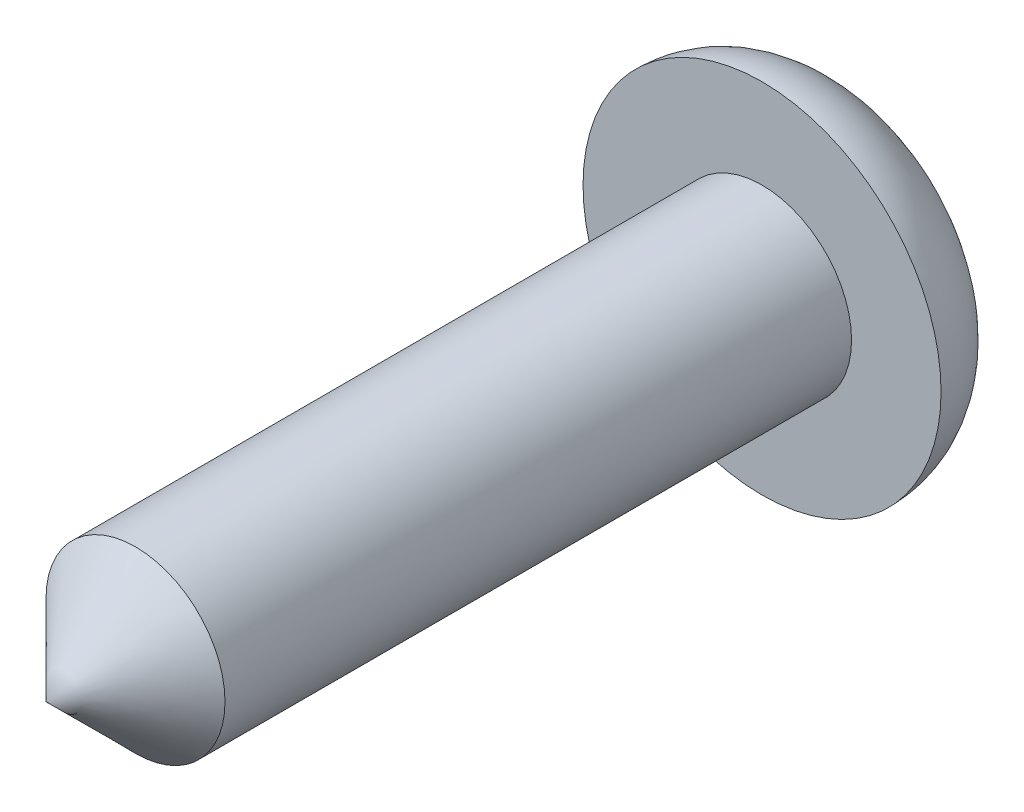
ISO-10303-21;
HEADER;
FILE_DESCRIPTION(('STEP AP214'),'2;1');
FILE_NAME('part.step','',(''),(''),'','','');
FILE_SCHEMA(('AUTOMOTIVE_DESIGN { 1 0 10303 214 1 1 1 1 }'));
ENDSEC;
DATA;
#1=APPLICATION_CONTEXT('core data for automotive mechanical design processes');
#2=APPLICATION_PROTOCOL_DEFINITION('international standard','automotive_design',2000,#1);
#3=PRODUCT_CONTEXT('',#1,'mechanical');
#4=PRODUCT('Part','Part','',(#3));
#5=PRODUCT_RELATED_PRODUCT_CATEGORY('part','',(#4));
#6=PRODUCT_DEFINITION_FORMATION('','',#4);
#7=PRODUCT_DEFINITION_CONTEXT('part definition',#1,'design');
#8=PRODUCT_DEFINITION('design','',#6,#7);
#9=PRODUCT_DEFINITION_SHAPE('','',#8);
#10=(LENGTH_UNIT() NAMED_UNIT(*) SI_UNIT(.MILLI.,.METRE.));
#11=(NAMED_UNIT(*) PLANE_ANGLE_UNIT() SI_UNIT($,.RADIAN.));
#12=(NAMED_UNIT(*) SI_UNIT($,.STERADIAN.) SOLID_ANGLE_UNIT());
#13=UNCERTAINTY_MEASURE_WITH_UNIT(LENGTH_MEASURE(1.E-05),#10,'distance_accuracy_value','');
#14=(GEOMETRIC_REPRESENTATION_CONTEXT(3) GLOBAL_UNCERTAINTY_ASSIGNED_CONTEXT((#13)) GLOBAL_UNIT_ASSIGNED_CONTEXT((#10,
#11,#12)) REPRESENTATION_CONTEXT('',''));
#15=CARTESIAN_POINT('',(0.,0.,0.));
#16=DIRECTION('',(0.,0.,1.));
#17=DIRECTION('',(1.,0.,0.));
#18=AXIS2_PLACEMENT_3D('',#15,#16,#17);
#19=CARTESIAN_POINT('',(-2.,0.,1.));
#20=DIRECTION('',(0.,0.,-1.));
#21=DIRECTION('',(-1.,0.,0.));
#22=AXIS2_PLACEMENT_3D('',#19,#20,#21);
#23=PLANE('',#22);
#24=CARTESIAN_POINT('',(0.,0.,1.));
#25=DIRECTION('',(0.,0.,1.));
#26=DIRECTION('',(1.,0.,0.));
#27=AXIS2_PLACEMENT_3D('',#24,#25,#26);
#28=CIRCLE('',#27,1.);
#29=CARTESIAN_POINT('',(1.,0.,1.));
#30=VERTEX_POINT('',#29);
#31=EDGE_CURVE('E11',#30,#30,#28,.T.);
#32=ORIENTED_EDGE('',*,*,#31,.F.);
#33=EDGE_LOOP('',(#32));
#34=FACE_BOUND('',#33,.T.);
#35=CARTESIAN_POINT('',(0.,0.,1.));
#36=DIRECTION('',(0.,0.,1.));
#37=DIRECTION('',(1.,0.,0.));
#38=AXIS2_PLACEMENT_3D('',#35,#36,#37);
#39=CIRCLE('',#38,2.);
#40=CARTESIAN_POINT('',(2.,0.,1.));
#41=VERTEX_POINT('',#40);
#42=EDGE_CURVE('E52',#41,#41,#39,.T.);
#43=ORIENTED_EDGE('',*,*,#42,.T.);
#44=EDGE_LOOP('',(#43));
#45=FACE_BOUND('',#44,.T.);
#46=ADVANCED_FACE('F32',(#34,#45),#23,.F.);
#47=CARTESIAN_POINT('',(0.,0.,9.));
#48=DIRECTION('',(0.,0.,1.));
#49=DIRECTION('',(1.,0.,0.));
#50=AXIS2_PLACEMENT_3D('',#47,#48,#49);
#51=CYLINDRICAL_SURFACE('',#50,1.);
#52=CARTESIAN_POINT('',(0.,0.,7.99999999999999));
#53=DIRECTION('',(0.,0.,1.));
#54=DIRECTION('',(1.,0.,0.));
#55=AXIS2_PLACEMENT_3D('',#52,#53,#54);
#56=CIRCLE('',#55,0.999999999999999);
#57=CARTESIAN_POINT('',(0.999999999999999,0.,7.99999999999999));
#58=VERTEX_POINT('',#57);
#59=EDGE_CURVE('E38',#58,#58,#56,.T.);
#60=ORIENTED_EDGE('',*,*,#59,.F.);
#61=EDGE_LOOP('',(#60));
#62=FACE_BOUND('',#61,.T.);
#63=ORIENTED_EDGE('',*,*,#31,.T.);
#64=EDGE_LOOP('',(#63));
#65=FACE_BOUND('',#64,.T.);
#66=ADVANCED_FACE('F45',(#62,#65),#51,.T.);
#67=CARTESIAN_POINT('',(0.,0.,7.99999999999999));
#68=DIRECTION('',(0.,0.,-1.));
#69=DIRECTION('',(-1.,0.,0.));
#70=AXIS2_PLACEMENT_3D('',#67,#68,#69);
#71=CONICAL_SURFACE('',#70,0.999999999999999,0.785398163397443);
#72=CARTESIAN_POINT('',(0.,0.,9.));
#73=VERTEX_POINT('',#72);
#74=VERTEX_LOOP('',#73);
#75=FACE_BOUND('',#74,.T.);
#76=ORIENTED_EDGE('',*,*,#59,.T.);
#77=EDGE_LOOP('',(#76));
#78=FACE_BOUND('',#77,.T.);
#79=ADVANCED_FACE('F41',(#75,#78),#71,.T.);
#80=CARTESIAN_POINT('',(0.,0.,0.));
#81=DIRECTION('',(0.,0.,1.));
#82=DIRECTION('',(1.,0.,0.));
#83=AXIS2_PLACEMENT_3D('',#80,#81,#82);
#84=PLANE('',#83);
#85=CARTESIAN_POINT('',(0.,0.,0.));
#86=DIRECTION('',(0.,0.,1.));
#87=DIRECTION('',(1.,0.,0.));
#88=AXIS2_PLACEMENT_3D('',#85,#86,#87);
#89=CIRCLE('',#88,1.);
#90=CARTESIAN_POINT('',(1.,0.,0.));
#91=VERTEX_POINT('',#90);
#92=EDGE_CURVE('E50',#91,#91,#89,.T.);
#93=ORIENTED_EDGE('',*,*,#92,.F.);
#94=EDGE_LOOP('',(#93));
#95=FACE_BOUND('',#94,.T.);
#96=ADVANCED_FACE('F44',(#95),#84,.F.);
#97=CARTESIAN_POINT('',(0.,0.,1.));
#98=DIRECTION('',(0.,0.,1.));
#99=DIRECTION('',(1.,0.,0.));
#100=AXIS2_PLACEMENT_3D('',#97,#98,#99);
#101=DEGENERATE_TOROIDAL_SURFACE('',#100,1.,1.,.T.);
#102=ORIENTED_EDGE('',*,*,#42,.F.);
#103=EDGE_LOOP('',(#102));
#104=FACE_BOUND('',#103,.T.);
#105=ORIENTED_EDGE('',*,*,#92,.T.);
#106=EDGE_LOOP('',(#105));
#107=FACE_BOUND('',#106,.T.);
#108=ADVANCED_FACE('F59',(#104,#107),#101,.T.);
#109=CLOSED_SHELL('',(#46,#66,#79,#96,#108));
#110=MANIFOLD_SOLID_BREP('B2',#109);
#111=ADVANCED_BREP_SHAPE_REPRESENTATION('',(#18,#110),#14);
#112=SHAPE_DEFINITION_REPRESENTATION(#9,#111);
ENDSEC;
END-ISO-10303-21;
